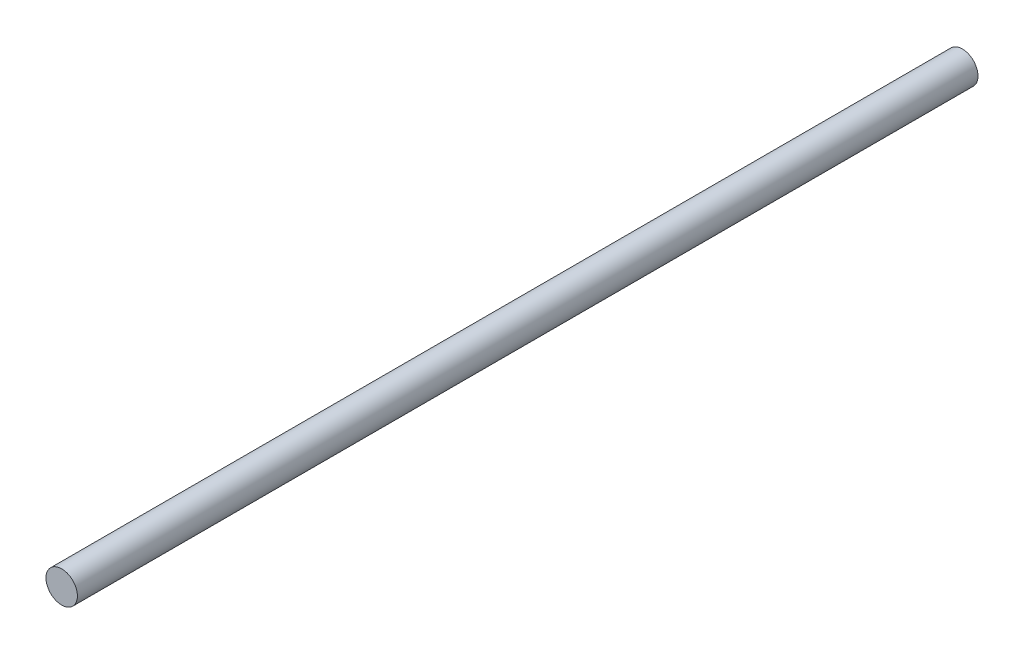
ISO-10303-21;
HEADER;
FILE_DESCRIPTION(('STEP AP214'),'2;1');
FILE_NAME('part.step','',(''),(''),'','','');
FILE_SCHEMA(('AUTOMOTIVE_DESIGN { 1 0 10303 214 1 1 1 1 }'));
ENDSEC;
DATA;
#1=APPLICATION_CONTEXT('core data for automotive mechanical design processes');
#2=APPLICATION_PROTOCOL_DEFINITION('international standard','automotive_design',2000,#1);
#3=PRODUCT_CONTEXT('',#1,'mechanical');
#4=PRODUCT('Part','Part','',(#3));
#5=PRODUCT_RELATED_PRODUCT_CATEGORY('part','',(#4));
#6=PRODUCT_DEFINITION_FORMATION('','',#4);
#7=PRODUCT_DEFINITION_CONTEXT('part definition',#1,'design');
#8=PRODUCT_DEFINITION('design','',#6,#7);
#9=PRODUCT_DEFINITION_SHAPE('','',#8);
#10=(LENGTH_UNIT() NAMED_UNIT(*) SI_UNIT(.MILLI.,.METRE.));
#11=(NAMED_UNIT(*) PLANE_ANGLE_UNIT() SI_UNIT($,.RADIAN.));
#12=(NAMED_UNIT(*) SI_UNIT($,.STERADIAN.) SOLID_ANGLE_UNIT());
#13=UNCERTAINTY_MEASURE_WITH_UNIT(LENGTH_MEASURE(1.E-05),#10,'distance_accuracy_value','');
#14=(GEOMETRIC_REPRESENTATION_CONTEXT(3) GLOBAL_UNCERTAINTY_ASSIGNED_CONTEXT((#13)) GLOBAL_UNIT_ASSIGNED_CONTEXT((#10,
#11,#12)) REPRESENTATION_CONTEXT('',''));
#15=CARTESIAN_POINT('',(0.,0.,0.));
#16=DIRECTION('',(0.,0.,1.));
#17=DIRECTION('',(1.,0.,0.));
#18=AXIS2_PLACEMENT_3D('',#15,#16,#17);
#19=CARTESIAN_POINT('',(0.,0.,86.));
#20=DIRECTION('',(0.,0.,-1.));
#21=DIRECTION('',(-1.,0.,0.));
#22=AXIS2_PLACEMENT_3D('',#19,#20,#21);
#23=CYLINDRICAL_SURFACE('',#22,1.5);
#24=CARTESIAN_POINT('',(0.,0.,86.));
#25=DIRECTION('',(0.,0.,1.));
#26=DIRECTION('',(1.,0.,0.));
#27=AXIS2_PLACEMENT_3D('',#24,#25,#26);
#28=CIRCLE('',#27,1.5);
#29=CARTESIAN_POINT('',(1.5,0.,86.));
#30=VERTEX_POINT('',#29);
#31=EDGE_CURVE('E10',#30,#30,#28,.T.);
#32=ORIENTED_EDGE('',*,*,#31,.F.);
#33=EDGE_LOOP('',(#32));
#34=FACE_BOUND('',#33,.T.);
#35=CARTESIAN_POINT('',(0.,0.,0.));
#36=DIRECTION('',(0.,0.,1.));
#37=DIRECTION('',(1.,0.,0.));
#38=AXIS2_PLACEMENT_3D('',#35,#36,#37);
#39=CIRCLE('',#38,1.5);
#40=CARTESIAN_POINT('',(1.5,0.,0.));
#41=VERTEX_POINT('',#40);
#42=EDGE_CURVE('E36',#41,#41,#39,.T.);
#43=ORIENTED_EDGE('',*,*,#42,.T.);
#44=EDGE_LOOP('',(#43));
#45=FACE_BOUND('',#44,.T.);
#46=ADVANCED_FACE('F33',(#34,#45),#23,.T.);
#47=CARTESIAN_POINT('',(0.,0.,86.));
#48=DIRECTION('',(0.,0.,1.));
#49=DIRECTION('',(1.,0.,0.));
#50=AXIS2_PLACEMENT_3D('',#47,#48,#49);
#51=PLANE('',#50);
#52=ORIENTED_EDGE('',*,*,#31,.T.);
#53=EDGE_LOOP('',(#52));
#54=FACE_BOUND('',#53,.T.);
#55=ADVANCED_FACE('F48',(#54),#51,.T.);
#56=CARTESIAN_POINT('',(0.,0.,0.));
#57=DIRECTION('',(0.,0.,1.));
#58=DIRECTION('',(1.,0.,0.));
#59=AXIS2_PLACEMENT_3D('',#56,#57,#58);
#60=PLANE('',#59);
#61=ORIENTED_EDGE('',*,*,#42,.F.);
#62=EDGE_LOOP('',(#61));
#63=FACE_BOUND('',#62,.T.);
#64=ADVANCED_FACE('F46',(#63),#60,.F.);
#65=CLOSED_SHELL('',(#46,#55,#64));
#66=MANIFOLD_SOLID_BREP('B2',#65);
#67=ADVANCED_BREP_SHAPE_REPRESENTATION('',(#18,#66),#14);
#68=SHAPE_DEFINITION_REPRESENTATION(#9,#67);
ENDSEC;
END-ISO-10303-21;
